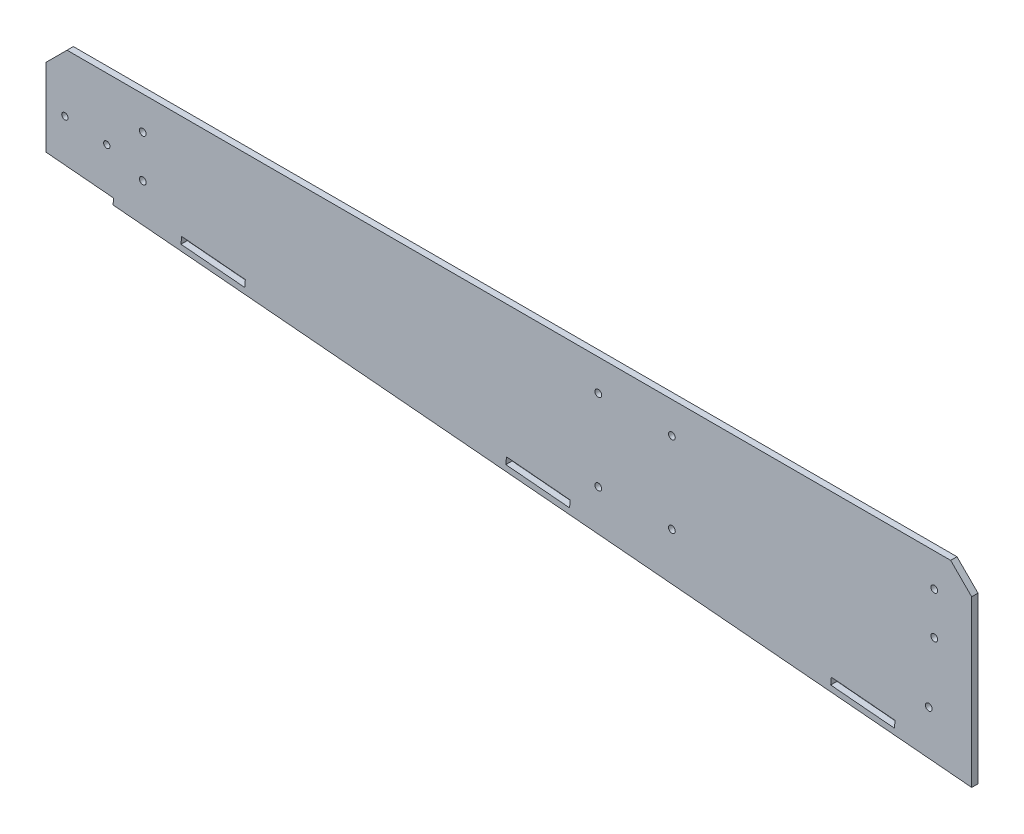
ISO-10303-21;
HEADER;
FILE_DESCRIPTION(('STEP AP214'),'2;1');
FILE_NAME('part.step','',(''),(''),'','','');
FILE_SCHEMA(('AUTOMOTIVE_DESIGN { 1 0 10303 214 1 1 1 1 }'));
ENDSEC;
DATA;
#1=APPLICATION_CONTEXT('core data for automotive mechanical design processes');
#2=APPLICATION_PROTOCOL_DEFINITION('international standard','automotive_design',2000,#1);
#3=PRODUCT_CONTEXT('',#1,'mechanical');
#4=PRODUCT('Part','Part','',(#3));
#5=PRODUCT_RELATED_PRODUCT_CATEGORY('part','',(#4));
#6=PRODUCT_DEFINITION_FORMATION('','',#4);
#7=PRODUCT_DEFINITION_CONTEXT('part definition',#1,'design');
#8=PRODUCT_DEFINITION('design','',#6,#7);
#9=PRODUCT_DEFINITION_SHAPE('','',#8);
#10=(LENGTH_UNIT() NAMED_UNIT(*) SI_UNIT(.MILLI.,.METRE.));
#11=(NAMED_UNIT(*) PLANE_ANGLE_UNIT() SI_UNIT($,.RADIAN.));
#12=(NAMED_UNIT(*) SI_UNIT($,.STERADIAN.) SOLID_ANGLE_UNIT());
#13=UNCERTAINTY_MEASURE_WITH_UNIT(LENGTH_MEASURE(1.E-05),#10,'distance_accuracy_value','');
#14=(GEOMETRIC_REPRESENTATION_CONTEXT(3) GLOBAL_UNCERTAINTY_ASSIGNED_CONTEXT((#13)) GLOBAL_UNIT_ASSIGNED_CONTEXT((#10,
#11,#12)) REPRESENTATION_CONTEXT('',''));
#15=CARTESIAN_POINT('',(0.,0.,0.));
#16=DIRECTION('',(0.,0.,1.));
#17=DIRECTION('',(1.,0.,0.));
#18=AXIS2_PLACEMENT_3D('',#15,#16,#17);
#19=CARTESIAN_POINT('',(-31.7701039956176,21.7677030305743,3.));
#20=DIRECTION('',(1.,0.,0.));
#21=DIRECTION('',(0.,0.,-1.));
#22=AXIS2_PLACEMENT_3D('',#19,#20,#21);
#23=PLANE('',#22);
#24=DIRECTION('',(0.,-1.,0.));
#25=VECTOR('',#24,1.);
#26=CARTESIAN_POINT('',(-31.7701039956176,21.7677030305743,3.));
#27=LINE('',#26,#25);
#28=CARTESIAN_POINT('',(-31.7701039956176,61.7677030305743,3.));
#29=VERTEX_POINT('',#28);
#30=CARTESIAN_POINT('',(-31.7701039956176,24.7791625432043,3.));
#31=VERTEX_POINT('',#30);
#32=EDGE_CURVE('E264',#29,#31,#27,.T.);
#33=ORIENTED_EDGE('',*,*,#32,.F.);
#34=DIRECTION('',(0.,0.,-1.));
#35=VECTOR('',#34,1.);
#36=CARTESIAN_POINT('',(-31.7701039956176,61.7677030305743,3.));
#37=LINE('',#36,#35);
#38=CARTESIAN_POINT('',(-31.7701039956176,61.7677030305743,0.));
#39=VERTEX_POINT('',#38);
#40=EDGE_CURVE('E312',#29,#39,#37,.T.);
#41=ORIENTED_EDGE('',*,*,#40,.T.);
#42=DIRECTION('',(0.,-1.,0.));
#43=VECTOR('',#42,1.);
#44=CARTESIAN_POINT('',(-31.7701039956176,21.7677030305743,0.));
#45=LINE('',#44,#43);
#46=CARTESIAN_POINT('',(-31.7701039956176,24.7791625432043,0.));
#47=VERTEX_POINT('',#46);
#48=EDGE_CURVE('E260',#39,#47,#45,.T.);
#49=ORIENTED_EDGE('',*,*,#48,.T.);
#50=DIRECTION('',(0.,0.,1.));
#51=VECTOR('',#50,1.);
#52=CARTESIAN_POINT('',(-31.7701039956176,24.7791625432043,-7.));
#53=LINE('',#52,#51);
#54=EDGE_CURVE('E257',#47,#31,#53,.T.);
#55=ORIENTED_EDGE('',*,*,#54,.T.);
#56=EDGE_LOOP('',(#33,#41,#49,#55));
#57=FACE_BOUND('',#56,.T.);
#58=ADVANCED_FACE('F35',(#57),#23,.F.);
#59=CARTESIAN_POINT('',(408.229896004382,-16.7273089208337,3.));
#60=DIRECTION('',(0.0871557427476615,0.996194698091745,0.));
#61=DIRECTION('',(-0.996194698091745,0.0871557427476615,0.));
#62=AXIS2_PLACEMENT_3D('',#59,#60,#61);
#63=PLANE('',#62);
#64=DIRECTION('',(0.996194698091745,-0.0871557427476615,0.));
#65=VECTOR('',#64,1.);
#66=CARTESIAN_POINT('',(408.229896004382,-16.7273089208337,3.));
#67=LINE('',#66,#65);
#68=CARTESIAN_POINT('',(0.108126343318207,18.9787192626491,3.));
#69=VERTEX_POINT('',#68);
#70=CARTESIAN_POINT('',(408.229896004382,-16.7273089208337,3.));
#71=VERTEX_POINT('',#70);
#72=EDGE_CURVE('E266',#69,#71,#67,.T.);
#73=ORIENTED_EDGE('',*,*,#72,.F.);
#74=DIRECTION('',(0.,0.,1.));
#75=VECTOR('',#74,1.);
#76=CARTESIAN_POINT('',(0.108126343318207,18.9787192626491,-7.));
#77=LINE('',#76,#75);
#78=CARTESIAN_POINT('',(0.108126343318207,18.9787192626491,0.));
#79=VERTEX_POINT('',#78);
#80=EDGE_CURVE('E256',#79,#69,#77,.T.);
#81=ORIENTED_EDGE('',*,*,#80,.F.);
#82=DIRECTION('',(0.996194698091745,-0.0871557427476615,0.));
#83=VECTOR('',#82,1.);
#84=CARTESIAN_POINT('',(408.229896004382,-16.7273089208337,0.));
#85=LINE('',#84,#83);
#86=CARTESIAN_POINT('',(408.229896004382,-16.7273089208337,0.));
#87=VERTEX_POINT('',#86);
#88=EDGE_CURVE('E275',#79,#87,#85,.T.);
#89=ORIENTED_EDGE('',*,*,#88,.T.);
#90=DIRECTION('',(0.,0.,-1.));
#91=VECTOR('',#90,1.);
#92=CARTESIAN_POINT('',(408.229896004382,-16.7273089208337,3.));
#93=LINE('',#92,#91);
#94=EDGE_CURVE('E273',#71,#87,#93,.T.);
#95=ORIENTED_EDGE('',*,*,#94,.F.);
#96=EDGE_LOOP('',(#73,#81,#89,#95));
#97=FACE_BOUND('',#96,.T.);
#98=ADVANCED_FACE('F348',(#97),#63,.F.);
#99=CARTESIAN_POINT('',(408.229896004382,71.7677030305743,3.));
#100=DIRECTION('',(-1.,0.,0.));
#101=DIRECTION('',(0.,0.,1.));
#102=AXIS2_PLACEMENT_3D('',#99,#100,#101);
#103=PLANE('',#102);
#104=DIRECTION('',(0.,1.,0.));
#105=VECTOR('',#104,1.);
#106=CARTESIAN_POINT('',(408.229896004382,71.7677030305743,0.));
#107=LINE('',#106,#105);
#108=CARTESIAN_POINT('',(408.229896004382,61.7677030305742,0.));
#109=VERTEX_POINT('',#108);
#110=EDGE_CURVE('E277',#87,#109,#107,.T.);
#111=ORIENTED_EDGE('',*,*,#110,.T.);
#112=DIRECTION('',(0.,0.,1.));
#113=VECTOR('',#112,1.);
#114=CARTESIAN_POINT('',(408.229896004382,61.7677030305742,3.));
#115=LINE('',#114,#113);
#116=CARTESIAN_POINT('',(408.229896004382,61.7677030305742,3.));
#117=VERTEX_POINT('',#116);
#118=EDGE_CURVE('E11',#109,#117,#115,.T.);
#119=ORIENTED_EDGE('',*,*,#118,.T.);
#120=DIRECTION('',(0.,1.,0.));
#121=VECTOR('',#120,1.);
#122=CARTESIAN_POINT('',(408.229896004382,71.7677030305743,3.));
#123=LINE('',#122,#121);
#124=EDGE_CURVE('E269',#71,#117,#123,.T.);
#125=ORIENTED_EDGE('',*,*,#124,.F.);
#126=ORIENTED_EDGE('',*,*,#94,.T.);
#127=EDGE_LOOP('',(#111,#119,#125,#126));
#128=FACE_BOUND('',#127,.T.);
#129=ADVANCED_FACE('F344',(#128),#103,.F.);
#130=CARTESIAN_POINT('',(-31.7701039956176,71.7677030305743,3.));
#131=DIRECTION('',(0.,-1.,0.));
#132=DIRECTION('',(0.,0.,-1.));
#133=AXIS2_PLACEMENT_3D('',#130,#131,#132);
#134=PLANE('',#133);
#135=DIRECTION('',(-1.,0.,0.));
#136=VECTOR('',#135,1.);
#137=CARTESIAN_POINT('',(-31.7701039956176,71.7677030305743,0.));
#138=LINE('',#137,#136);
#139=CARTESIAN_POINT('',(398.229896004382,71.7677030305743,0.));
#140=VERTEX_POINT('',#139);
#141=CARTESIAN_POINT('',(-21.7701039956176,71.7677030305743,0.));
#142=VERTEX_POINT('',#141);
#143=EDGE_CURVE('E267',#140,#142,#138,.T.);
#144=ORIENTED_EDGE('',*,*,#143,.T.);
#145=DIRECTION('',(0.,0.,1.));
#146=VECTOR('',#145,1.);
#147=CARTESIAN_POINT('',(-21.7701039956176,71.7677030305743,3.));
#148=LINE('',#147,#146);
#149=CARTESIAN_POINT('',(-21.7701039956176,71.7677030305743,3.));
#150=VERTEX_POINT('',#149);
#151=EDGE_CURVE('E56',#142,#150,#148,.T.);
#152=ORIENTED_EDGE('',*,*,#151,.T.);
#153=DIRECTION('',(-1.,0.,0.));
#154=VECTOR('',#153,1.);
#155=CARTESIAN_POINT('',(-31.7701039956176,71.7677030305743,3.));
#156=LINE('',#155,#154);
#157=CARTESIAN_POINT('',(398.229896004382,71.7677030305743,3.));
#158=VERTEX_POINT('',#157);
#159=EDGE_CURVE('E271',#158,#150,#156,.T.);
#160=ORIENTED_EDGE('',*,*,#159,.F.);
#161=DIRECTION('',(0.,0.,-1.));
#162=VECTOR('',#161,1.);
#163=CARTESIAN_POINT('',(398.229896004382,71.7677030305743,3.));
#164=LINE('',#163,#162);
#165=EDGE_CURVE('E319',#158,#140,#164,.T.);
#166=ORIENTED_EDGE('',*,*,#165,.T.);
#167=EDGE_LOOP('',(#144,#152,#160,#166));
#168=FACE_BOUND('',#167,.T.);
#169=ADVANCED_FACE('F338',(#168),#134,.F.);
#170=CARTESIAN_POINT('',(0.,0.,3.));
#171=DIRECTION('',(0.,0.,-1.));
#172=DIRECTION('',(-1.,0.,0.));
#173=AXIS2_PLACEMENT_3D('',#170,#171,#172);
#174=PLANE('',#173);
#175=CARTESIAN_POINT('',(390.440589080788,56.0238654816803,3.));
#176=DIRECTION('',(0.,0.,-1.));
#177=DIRECTION('',(-1.,0.,0.));
#178=AXIS2_PLACEMENT_3D('',#175,#176,#177);
#179=CIRCLE('',#178,1.60000000000002);
#180=CARTESIAN_POINT('',(388.840589080788,56.0238654816803,3.));
#181=VERTEX_POINT('',#180);
#182=EDGE_CURVE('E619',#181,#181,#179,.T.);
#183=ORIENTED_EDGE('',*,*,#182,.T.);
#184=EDGE_LOOP('',(#183));
#185=FACE_BOUND('',#184,.T.);
#186=CARTESIAN_POINT('',(14.2298960043213,36.0238654816881,3.));
#187=DIRECTION('',(0.,0.,-1.));
#188=DIRECTION('',(-1.,0.,0.));
#189=AXIS2_PLACEMENT_3D('',#186,#187,#188);
#190=CIRCLE('',#189,1.60000000000004);
#191=CARTESIAN_POINT('',(12.6298960043213,36.0238654816881,3.));
#192=VERTEX_POINT('',#191);
#193=EDGE_CURVE('E623',#192,#192,#190,.T.);
#194=ORIENTED_EDGE('',*,*,#193,.T.);
#195=EDGE_LOOP('',(#194));
#196=FACE_BOUND('',#195,.T.);
#197=CARTESIAN_POINT('',(14.2298960043213,56.0238654816881,3.));
#198=DIRECTION('',(0.,0.,-1.));
#199=DIRECTION('',(-1.,0.,0.));
#200=AXIS2_PLACEMENT_3D('',#197,#198,#199);
#201=CIRCLE('',#200,1.60000000000004);
#202=CARTESIAN_POINT('',(12.6298960043213,56.0238654816881,3.));
#203=VERTEX_POINT('',#202);
#204=EDGE_CURVE('E626',#203,#203,#201,.T.);
#205=ORIENTED_EDGE('',*,*,#204,.T.);
#206=EDGE_LOOP('',(#205));
#207=FACE_BOUND('',#206,.T.);
#208=CARTESIAN_POINT('',(390.440589080788,36.0238654816803,3.));
#209=DIRECTION('',(0.,0.,-1.));
#210=DIRECTION('',(-1.,0.,0.));
#211=AXIS2_PLACEMENT_3D('',#208,#209,#210);
#212=CIRCLE('',#211,1.60000000000002);
#213=CARTESIAN_POINT('',(388.840589080788,36.0238654816803,3.));
#214=VERTEX_POINT('',#213);
#215=EDGE_CURVE('E563',#214,#214,#212,.T.);
#216=ORIENTED_EDGE('',*,*,#215,.T.);
#217=EDGE_LOOP('',(#216));
#218=FACE_BOUND('',#217,.T.);
#219=CARTESIAN_POINT('',(387.825916798358,6.13802453892796,3.));
#220=DIRECTION('',(0.,0.,-1.));
#221=DIRECTION('',(-1.,0.,0.));
#222=AXIS2_PLACEMENT_3D('',#219,#220,#221);
#223=CIRCLE('',#222,1.60000000000002);
#224=CARTESIAN_POINT('',(386.225916798358,6.13802453892796,3.));
#225=VERTEX_POINT('',#224);
#226=EDGE_CURVE('E612',#225,#225,#223,.T.);
#227=ORIENTED_EDGE('',*,*,#226,.T.);
#228=EDGE_LOOP('',(#227));
#229=FACE_BOUND('',#228,.T.);
#230=CARTESIAN_POINT('',(265.729896004382,18.2779728998452,3.));
#231=DIRECTION('',(0.,0.,-1.));
#232=DIRECTION('',(-1.,0.,0.));
#233=AXIS2_PLACEMENT_3D('',#230,#231,#232);
#234=CIRCLE('',#233,1.60000000000002);
#235=CARTESIAN_POINT('',(264.129896004382,18.2779728998452,3.));
#236=VERTEX_POINT('',#235);
#237=EDGE_CURVE('E557',#236,#236,#234,.T.);
#238=ORIENTED_EDGE('',*,*,#237,.T.);
#239=EDGE_LOOP('',(#238));
#240=FACE_BOUND('',#239,.T.);
#241=CARTESIAN_POINT('',(230.729896004382,18.2779728998452,3.));
#242=DIRECTION('',(0.,0.,-1.));
#243=DIRECTION('',(-1.,0.,0.));
#244=AXIS2_PLACEMENT_3D('',#241,#242,#243);
#245=CIRCLE('',#244,1.59999999999973);
#246=CARTESIAN_POINT('',(229.129896004383,18.2779728998452,3.));
#247=VERTEX_POINT('',#246);
#248=EDGE_CURVE('E546',#247,#247,#245,.T.);
#249=ORIENTED_EDGE('',*,*,#248,.T.);
#250=EDGE_LOOP('',(#249));
#251=FACE_BOUND('',#250,.T.);
#252=CARTESIAN_POINT('',(230.729896004382,56.7835263993104,3.));
#253=DIRECTION('',(0.,0.,-1.));
#254=DIRECTION('',(-1.,0.,0.));
#255=AXIS2_PLACEMENT_3D('',#252,#253,#254);
#256=CIRCLE('',#255,1.59999999999999);
#257=CARTESIAN_POINT('',(229.129896004382,56.7835263993104,3.));
#258=VERTEX_POINT('',#257);
#259=EDGE_CURVE('E541',#258,#258,#256,.T.);
#260=ORIENTED_EDGE('',*,*,#259,.T.);
#261=EDGE_LOOP('',(#260));
#262=FACE_BOUND('',#261,.T.);
#263=CARTESIAN_POINT('',(-2.86826506399695,42.3269760325064,3.));
#264=DIRECTION('',(0.,0.,-1.));
#265=DIRECTION('',(-1.,0.,0.));
#266=AXIS2_PLACEMENT_3D('',#263,#264,#265);
#267=CIRCLE('',#266,1.49999999994489);
#268=CARTESIAN_POINT('',(-4.36826506394184,42.3269760325064,3.));
#269=VERTEX_POINT('',#268);
#270=EDGE_CURVE('E593',#269,#269,#267,.T.);
#271=ORIENTED_EDGE('',*,*,#270,.T.);
#272=EDGE_LOOP('',(#271));
#273=FACE_BOUND('',#272,.T.);
#274=CARTESIAN_POINT('',(-22.7921590258319,44.0700908874597,3.));
#275=DIRECTION('',(0.,0.,-1.));
#276=DIRECTION('',(-1.,0.,0.));
#277=AXIS2_PLACEMENT_3D('',#274,#275,#276);
#278=CIRCLE('',#277,1.49999999994489);
#279=CARTESIAN_POINT('',(-24.2921590257767,44.0700908874597,3.));
#280=VERTEX_POINT('',#279);
#281=EDGE_CURVE('E568',#280,#280,#278,.T.);
#282=ORIENTED_EDGE('',*,*,#281,.T.);
#283=EDGE_LOOP('',(#282));
#284=FACE_BOUND('',#283,.T.);
#285=CARTESIAN_POINT('',(265.729896004382,56.7835263993079,3.));
#286=DIRECTION('',(0.,0.,-1.));
#287=DIRECTION('',(-1.,0.,0.));
#288=AXIS2_PLACEMENT_3D('',#285,#286,#287);
#289=CIRCLE('',#288,1.60000000000002);
#290=CARTESIAN_POINT('',(264.129896004382,56.7835263993079,3.));
#291=VERTEX_POINT('',#290);
#292=EDGE_CURVE('E234',#291,#291,#289,.T.);
#293=ORIENTED_EDGE('',*,*,#292,.T.);
#294=EDGE_LOOP('',(#293));
#295=FACE_BOUND('',#294,.T.);
#296=DIRECTION('',(-0.0871557427476403,-0.996194698091747,0.));
#297=VECTOR('',#296,1.);
#298=CARTESIAN_POINT('',(341.508011452001,-4.66621742064363,3.));
#299=LINE('',#298,#297);
#300=CARTESIAN_POINT('',(341.508011452001,-4.66621742064363,3.));
#301=VERTEX_POINT('',#300);
#302=CARTESIAN_POINT('',(341.211681926659,-8.05327939415556,3.));
#303=VERTEX_POINT('',#302);
#304=EDGE_CURVE('E190',#301,#303,#299,.T.);
#305=ORIENTED_EDGE('',*,*,#304,.F.);
#306=DIRECTION('',(-0.996194698091747,0.0871557427476466,0.));
#307=VECTOR('',#306,1.);
#308=CARTESIAN_POINT('',(371.792330273991,-7.31575200017209,3.));
#309=LINE('',#308,#307);
#310=CARTESIAN_POINT('',(371.792330273991,-7.31575200017209,3.));
#311=VERTEX_POINT('',#310);
#312=EDGE_CURVE('E195',#311,#301,#309,.T.);
#313=ORIENTED_EDGE('',*,*,#312,.F.);
#314=DIRECTION('',(0.0871557427476403,0.996194698091747,0.));
#315=VECTOR('',#314,1.);
#316=CARTESIAN_POINT('',(371.792330273991,-7.31575200017209,3.));
#317=LINE('',#316,#315);
#318=CARTESIAN_POINT('',(371.496000748649,-10.702813973684,3.));
#319=VERTEX_POINT('',#318);
#320=EDGE_CURVE('E200',#319,#311,#317,.T.);
#321=ORIENTED_EDGE('',*,*,#320,.F.);
#322=DIRECTION('',(0.996194698091747,-0.0871557427476467,0.));
#323=VECTOR('',#322,1.);
#324=CARTESIAN_POINT('',(371.496000748649,-10.702813973684,3.));
#325=LINE('',#324,#323);
#326=EDGE_CURVE('E179',#303,#319,#325,.T.);
#327=ORIENTED_EDGE('',*,*,#326,.F.);
#328=EDGE_LOOP('',(#305,#313,#321,#327));
#329=FACE_BOUND('',#328,.T.);
#330=DIRECTION('',(-0.0871557427476403,-0.996194698091747,0.));
#331=VECTOR('',#330,1.);
#332=CARTESIAN_POINT('',(187.097833247781,8.8429227052439,3.));
#333=LINE('',#332,#331);
#334=CARTESIAN_POINT('',(187.097833247781,8.8429227052439,3.));
#335=VERTEX_POINT('',#334);
#336=CARTESIAN_POINT('',(186.801503722439,5.45586073173197,3.));
#337=VERTEX_POINT('',#336);
#338=EDGE_CURVE('E212',#335,#337,#333,.T.);
#339=ORIENTED_EDGE('',*,*,#338,.F.);
#340=DIRECTION('',(-0.996194698091747,0.0871557427476466,0.));
#341=VECTOR('',#340,1.);
#342=CARTESIAN_POINT('',(217.38215206977,6.19338812571544,3.));
#343=LINE('',#342,#341);
#344=CARTESIAN_POINT('',(217.38215206977,6.19338812571544,3.));
#345=VERTEX_POINT('',#344);
#346=EDGE_CURVE('E210',#345,#335,#343,.T.);
#347=ORIENTED_EDGE('',*,*,#346,.F.);
#348=DIRECTION('',(0.0871557427476403,0.996194698091747,0.));
#349=VECTOR('',#348,1.);
#350=CARTESIAN_POINT('',(217.38215206977,6.19338812571544,3.));
#351=LINE('',#350,#349);
#352=CARTESIAN_POINT('',(217.085822544428,2.8063261522035,3.));
#353=VERTEX_POINT('',#352);
#354=EDGE_CURVE('E219',#353,#345,#351,.T.);
#355=ORIENTED_EDGE('',*,*,#354,.F.);
#356=DIRECTION('',(0.996194698091747,-0.0871557427476467,0.));
#357=VECTOR('',#356,1.);
#358=CARTESIAN_POINT('',(217.085822544428,2.8063261522035,3.));
#359=LINE('',#358,#357);
#360=EDGE_CURVE('E216',#337,#353,#359,.T.);
#361=ORIENTED_EDGE('',*,*,#360,.F.);
#362=EDGE_LOOP('',(#339,#347,#355,#361));
#363=FACE_BOUND('',#362,.T.);
#364=DIRECTION('',(-0.0871557427476403,-0.996194698091747,0.));
#365=VECTOR('',#364,1.);
#366=CARTESIAN_POINT('',(32.6876550435604,22.3520628311314,3.));
#367=LINE('',#366,#365);
#368=CARTESIAN_POINT('',(32.6876550435604,22.3520628311314,3.));
#369=VERTEX_POINT('',#368);
#370=CARTESIAN_POINT('',(32.3913255182184,18.9650008576195,3.));
#371=VERTEX_POINT('',#370);
#372=EDGE_CURVE('E233',#369,#371,#367,.T.);
#373=ORIENTED_EDGE('',*,*,#372,.F.);
#374=DIRECTION('',(-0.996194698091747,0.0871557427476467,0.));
#375=VECTOR('',#374,1.);
#376=CARTESIAN_POINT('',(62.9719738655495,19.702528251603,3.));
#377=LINE('',#376,#375);
#378=CARTESIAN_POINT('',(62.9719738655495,19.702528251603,3.));
#379=VERTEX_POINT('',#378);
#380=EDGE_CURVE('E231',#379,#369,#377,.T.);
#381=ORIENTED_EDGE('',*,*,#380,.F.);
#382=DIRECTION('',(0.0871557427476403,0.996194698091747,0.));
#383=VECTOR('',#382,1.);
#384=CARTESIAN_POINT('',(62.9719738655495,19.702528251603,3.));
#385=LINE('',#384,#383);
#386=CARTESIAN_POINT('',(62.6756443402076,16.315466278091,3.));
#387=VERTEX_POINT('',#386);
#388=EDGE_CURVE('E240',#387,#379,#385,.T.);
#389=ORIENTED_EDGE('',*,*,#388,.F.);
#390=DIRECTION('',(0.996194698091747,-0.0871557427476467,0.));
#391=VECTOR('',#390,1.);
#392=CARTESIAN_POINT('',(62.6756443402076,16.315466278091,3.));
#393=LINE('',#392,#391);
#394=EDGE_CURVE('E237',#371,#387,#393,.T.);
#395=ORIENTED_EDGE('',*,*,#394,.F.);
#396=EDGE_LOOP('',(#373,#381,#389,#395));
#397=FACE_BOUND('',#396,.T.);
#398=ORIENTED_EDGE('',*,*,#159,.T.);
#399=DIRECTION('',(0.707106781186549,0.707106781186546,0.));
#400=VECTOR('',#399,1.);
#401=CARTESIAN_POINT('',(-31.7701039956176,61.7677030305743,3.));
#402=LINE('',#401,#400);
#403=EDGE_CURVE('E43',#150,#29,#402,.F.);
#404=ORIENTED_EDGE('',*,*,#403,.T.);
#405=ORIENTED_EDGE('',*,*,#32,.T.);
#406=DIRECTION('',(-0.996194698091745,0.0871557427476614,0.));
#407=VECTOR('',#406,1.);
#408=CARTESIAN_POINT('',(0.36959357156119,21.9673033569244,3.));
#409=LINE('',#408,#407);
#410=CARTESIAN_POINT('',(0.36959357156119,21.9673033569244,3.));
#411=VERTEX_POINT('',#410);
#412=EDGE_CURVE('E253',#411,#31,#409,.T.);
#413=ORIENTED_EDGE('',*,*,#412,.F.);
#414=DIRECTION('',(0.0871557427476612,0.996194698091745,0.));
#415=VECTOR('',#414,1.);
#416=CARTESIAN_POINT('',(0.108126343318207,18.9787192626491,3.));
#417=LINE('',#416,#415);
#418=EDGE_CURVE('E207',#69,#411,#417,.T.);
#419=ORIENTED_EDGE('',*,*,#418,.F.);
#420=ORIENTED_EDGE('',*,*,#72,.T.);
#421=ORIENTED_EDGE('',*,*,#124,.T.);
#422=DIRECTION('',(0.707106781186546,-0.707106781186549,0.));
#423=VECTOR('',#422,1.);
#424=CARTESIAN_POINT('',(398.229896004382,71.7677030305743,3.));
#425=LINE('',#424,#423);
#426=EDGE_CURVE('E323',#117,#158,#425,.F.);
#427=ORIENTED_EDGE('',*,*,#426,.T.);
#428=EDGE_LOOP('',(#398,#404,#405,#413,#419,#420,#421,#427));
#429=FACE_BOUND('',#428,.T.);
#430=ADVANCED_FACE('F197',(#185,#196,#207,#218,#229,#240,#251,#262,#273,#284,#295,#329,#363,
#397,#429),#174,.F.);
#431=CARTESIAN_POINT('',(0.,0.,0.));
#432=DIRECTION('',(0.,0.,-1.));
#433=DIRECTION('',(-1.,0.,0.));
#434=AXIS2_PLACEMENT_3D('',#431,#432,#433);
#435=PLANE('',#434);
#436=CARTESIAN_POINT('',(390.440589080788,56.0238654816803,0.));
#437=DIRECTION('',(0.,0.,-1.));
#438=DIRECTION('',(-1.,0.,0.));
#439=AXIS2_PLACEMENT_3D('',#436,#437,#438);
#440=CIRCLE('',#439,1.60000000000002);
#441=CARTESIAN_POINT('',(388.840589080788,56.0238654816803,0.));
#442=VERTEX_POINT('',#441);
#443=EDGE_CURVE('E629',#442,#442,#440,.T.);
#444=ORIENTED_EDGE('',*,*,#443,.F.);
#445=EDGE_LOOP('',(#444));
#446=FACE_BOUND('',#445,.T.);
#447=CARTESIAN_POINT('',(14.2298960043213,36.0238654816881,0.));
#448=DIRECTION('',(0.,0.,-1.));
#449=DIRECTION('',(-1.,0.,0.));
#450=AXIS2_PLACEMENT_3D('',#447,#448,#449);
#451=CIRCLE('',#450,1.60000000000004);
#452=CARTESIAN_POINT('',(12.6298960043213,36.0238654816881,0.));
#453=VERTEX_POINT('',#452);
#454=EDGE_CURVE('E633',#453,#453,#451,.T.);
#455=ORIENTED_EDGE('',*,*,#454,.F.);
#456=EDGE_LOOP('',(#455));
#457=FACE_BOUND('',#456,.T.);
#458=CARTESIAN_POINT('',(14.2298960043213,56.0238654816881,0.));
#459=DIRECTION('',(0.,0.,-1.));
#460=DIRECTION('',(-1.,0.,0.));
#461=AXIS2_PLACEMENT_3D('',#458,#459,#460);
#462=CIRCLE('',#461,1.60000000000004);
#463=CARTESIAN_POINT('',(12.6298960043213,56.0238654816881,0.));
#464=VERTEX_POINT('',#463);
#465=EDGE_CURVE('E630',#464,#464,#462,.T.);
#466=ORIENTED_EDGE('',*,*,#465,.F.);
#467=EDGE_LOOP('',(#466));
#468=FACE_BOUND('',#467,.T.);
#469=CARTESIAN_POINT('',(390.440589080788,36.0238654816803,0.));
#470=DIRECTION('',(0.,0.,-1.));
#471=DIRECTION('',(-1.,0.,0.));
#472=AXIS2_PLACEMENT_3D('',#469,#470,#471);
#473=CIRCLE('',#472,1.60000000000002);
#474=CARTESIAN_POINT('',(388.840589080788,36.0238654816803,0.));
#475=VERTEX_POINT('',#474);
#476=EDGE_CURVE('E615',#475,#475,#473,.T.);
#477=ORIENTED_EDGE('',*,*,#476,.F.);
#478=EDGE_LOOP('',(#477));
#479=FACE_BOUND('',#478,.T.);
#480=CARTESIAN_POINT('',(387.825916798358,6.13802453892796,0.));
#481=DIRECTION('',(0.,0.,-1.));
#482=DIRECTION('',(-1.,0.,0.));
#483=AXIS2_PLACEMENT_3D('',#480,#481,#482);
#484=CIRCLE('',#483,1.60000000000002);
#485=CARTESIAN_POINT('',(386.225916798358,6.13802453892796,0.));
#486=VERTEX_POINT('',#485);
#487=EDGE_CURVE('E616',#486,#486,#484,.T.);
#488=ORIENTED_EDGE('',*,*,#487,.F.);
#489=EDGE_LOOP('',(#488));
#490=FACE_BOUND('',#489,.T.);
#491=CARTESIAN_POINT('',(265.729896004382,18.2779728998452,0.));
#492=DIRECTION('',(0.,0.,-1.));
#493=DIRECTION('',(-1.,0.,0.));
#494=AXIS2_PLACEMENT_3D('',#491,#492,#493);
#495=CIRCLE('',#494,1.60000000000002);
#496=CARTESIAN_POINT('',(264.129896004382,18.2779728998452,0.));
#497=VERTEX_POINT('',#496);
#498=EDGE_CURVE('E560',#497,#497,#495,.T.);
#499=ORIENTED_EDGE('',*,*,#498,.F.);
#500=EDGE_LOOP('',(#499));
#501=FACE_BOUND('',#500,.T.);
#502=CARTESIAN_POINT('',(230.729896004382,18.2779728998452,0.));
#503=DIRECTION('',(0.,0.,-1.));
#504=DIRECTION('',(-1.,0.,0.));
#505=AXIS2_PLACEMENT_3D('',#502,#503,#504);
#506=CIRCLE('',#505,1.59999999999973);
#507=CARTESIAN_POINT('',(229.129896004383,18.2779728998452,0.));
#508=VERTEX_POINT('',#507);
#509=EDGE_CURVE('E551',#508,#508,#506,.T.);
#510=ORIENTED_EDGE('',*,*,#509,.F.);
#511=EDGE_LOOP('',(#510));
#512=FACE_BOUND('',#511,.T.);
#513=CARTESIAN_POINT('',(230.729896004382,56.7835263993104,0.));
#514=DIRECTION('',(0.,0.,-1.));
#515=DIRECTION('',(-1.,0.,0.));
#516=AXIS2_PLACEMENT_3D('',#513,#514,#515);
#517=CIRCLE('',#516,1.59999999999999);
#518=CARTESIAN_POINT('',(229.129896004382,56.7835263993104,0.));
#519=VERTEX_POINT('',#518);
#520=EDGE_CURVE('E544',#519,#519,#517,.T.);
#521=ORIENTED_EDGE('',*,*,#520,.F.);
#522=EDGE_LOOP('',(#521));
#523=FACE_BOUND('',#522,.T.);
#524=CARTESIAN_POINT('',(-2.86826506399695,42.3269760325064,0.));
#525=DIRECTION('',(0.,0.,-1.));
#526=DIRECTION('',(-1.,0.,0.));
#527=AXIS2_PLACEMENT_3D('',#524,#525,#526);
#528=CIRCLE('',#527,1.49999999994489);
#529=CARTESIAN_POINT('',(-4.36826506394184,42.3269760325064,0.));
#530=VERTEX_POINT('',#529);
#531=EDGE_CURVE('E548',#530,#530,#528,.T.);
#532=ORIENTED_EDGE('',*,*,#531,.F.);
#533=EDGE_LOOP('',(#532));
#534=FACE_BOUND('',#533,.T.);
#535=CARTESIAN_POINT('',(-22.7921590258319,44.0700908874597,0.));
#536=DIRECTION('',(0.,0.,-1.));
#537=DIRECTION('',(-1.,0.,0.));
#538=AXIS2_PLACEMENT_3D('',#535,#536,#537);
#539=CIRCLE('',#538,1.49999999994489);
#540=CARTESIAN_POINT('',(-24.2921590257767,44.0700908874597,0.));
#541=VERTEX_POINT('',#540);
#542=EDGE_CURVE('E588',#541,#541,#539,.T.);
#543=ORIENTED_EDGE('',*,*,#542,.F.);
#544=EDGE_LOOP('',(#543));
#545=FACE_BOUND('',#544,.T.);
#546=CARTESIAN_POINT('',(265.729896004382,56.7835263993079,0.));
#547=DIRECTION('',(0.,0.,-1.));
#548=DIRECTION('',(-1.,0.,0.));
#549=AXIS2_PLACEMENT_3D('',#546,#547,#548);
#550=CIRCLE('',#549,1.60000000000002);
#551=CARTESIAN_POINT('',(264.129896004382,56.7835263993079,0.));
#552=VERTEX_POINT('',#551);
#553=EDGE_CURVE('E566',#552,#552,#550,.T.);
#554=ORIENTED_EDGE('',*,*,#553,.F.);
#555=EDGE_LOOP('',(#554));
#556=FACE_BOUND('',#555,.T.);
#557=DIRECTION('',(0.996194698091747,-0.0871557427476466,0.));
#558=VECTOR('',#557,1.);
#559=CARTESIAN_POINT('',(2.18899695329738,25.0203496667776,0.));
#560=LINE('',#559,#558);
#561=CARTESIAN_POINT('',(341.508011452001,-4.66621742064363,0.));
#562=VERTEX_POINT('',#561);
#563=CARTESIAN_POINT('',(371.792330273991,-7.31575200017209,0.));
#564=VERTEX_POINT('',#563);
#565=EDGE_CURVE('E310',#562,#564,#560,.T.);
#566=ORIENTED_EDGE('',*,*,#565,.F.);
#567=DIRECTION('',(0.0871557427476403,0.996194698091747,0.));
#568=VECTOR('',#567,1.);
#569=CARTESIAN_POINT('',(339.319014498704,-29.6865670874191,0.));
#570=LINE('',#569,#568);
#571=CARTESIAN_POINT('',(341.211681926659,-8.05327939415556,0.));
#572=VERTEX_POINT('',#571);
#573=EDGE_CURVE('E305',#572,#562,#570,.T.);
#574=ORIENTED_EDGE('',*,*,#573,.F.);
#575=DIRECTION('',(-0.996194698091747,0.0871557427476467,0.));
#576=VECTOR('',#575,1.);
#577=CARTESIAN_POINT('',(1.89266742795539,21.6332876932657,0.));
#578=LINE('',#577,#576);
#579=CARTESIAN_POINT('',(371.496000748649,-10.702813973684,0.));
#580=VERTEX_POINT('',#579);
#581=EDGE_CURVE('E182',#580,#572,#578,.T.);
#582=ORIENTED_EDGE('',*,*,#581,.F.);
#583=DIRECTION('',(-0.0871557427476403,-0.996194698091747,0.));
#584=VECTOR('',#583,1.);
#585=CARTESIAN_POINT('',(369.603333320693,-32.3361016669474,0.));
#586=LINE('',#585,#584);
#587=EDGE_CURVE('E308',#564,#580,#586,.T.);
#588=ORIENTED_EDGE('',*,*,#587,.F.);
#589=EDGE_LOOP('',(#566,#574,#582,#588));
#590=FACE_BOUND('',#589,.T.);
#591=DIRECTION('',(0.996194698091747,-0.0871557427476466,0.));
#592=VECTOR('',#591,1.);
#593=CARTESIAN_POINT('',(2.18899695329758,25.0203496667799,0.));
#594=LINE('',#593,#592);
#595=CARTESIAN_POINT('',(187.097833247781,8.8429227052439,0.));
#596=VERTEX_POINT('',#595);
#597=CARTESIAN_POINT('',(217.38215206977,6.19338812571544,0.));
#598=VERTEX_POINT('',#597);
#599=EDGE_CURVE('E303',#596,#598,#594,.T.);
#600=ORIENTED_EDGE('',*,*,#599,.F.);
#601=DIRECTION('',(0.0871557427476403,0.996194698091747,0.));
#602=VECTOR('',#601,1.);
#603=CARTESIAN_POINT('',(184.908836294484,-16.1774269615349,0.));
#604=LINE('',#603,#602);
#605=CARTESIAN_POINT('',(186.801503722439,5.45586073173197,0.));
#606=VERTEX_POINT('',#605);
#607=EDGE_CURVE('E296',#606,#596,#604,.T.);
#608=ORIENTED_EDGE('',*,*,#607,.F.);
#609=DIRECTION('',(-0.996194698091747,0.0871557427476467,0.));
#610=VECTOR('',#609,1.);
#611=CARTESIAN_POINT('',(1.89266742795559,21.633287693268,0.));
#612=LINE('',#611,#610);
#613=CARTESIAN_POINT('',(217.085822544428,2.8063261522035,0.));
#614=VERTEX_POINT('',#613);
#615=EDGE_CURVE('E298',#614,#606,#612,.T.);
#616=ORIENTED_EDGE('',*,*,#615,.F.);
#617=DIRECTION('',(-0.0871557427476403,-0.996194698091747,0.));
#618=VECTOR('',#617,1.);
#619=CARTESIAN_POINT('',(215.193155116473,-18.8269615410632,0.));
#620=LINE('',#619,#618);
#621=EDGE_CURVE('E301',#598,#614,#620,.T.);
#622=ORIENTED_EDGE('',*,*,#621,.F.);
#623=EDGE_LOOP('',(#600,#608,#616,#622));
#624=FACE_BOUND('',#623,.T.);
#625=DIRECTION('',(0.996194698091747,-0.0871557427476467,0.));
#626=VECTOR('',#625,1.);
#627=CARTESIAN_POINT('',(2.18899695329779,25.0203496667822,0.));
#628=LINE('',#627,#626);
#629=CARTESIAN_POINT('',(32.6876550435604,22.3520628311314,0.));
#630=VERTEX_POINT('',#629);
#631=CARTESIAN_POINT('',(62.9719738655495,19.702528251603,0.));
#632=VERTEX_POINT('',#631);
#633=EDGE_CURVE('E294',#630,#632,#628,.T.);
#634=ORIENTED_EDGE('',*,*,#633,.F.);
#635=DIRECTION('',(0.0871557427476403,0.996194698091747,0.));
#636=VECTOR('',#635,1.);
#637=CARTESIAN_POINT('',(30.4986580902628,-2.66828683565065,0.));
#638=LINE('',#637,#636);
#639=CARTESIAN_POINT('',(32.3913255182184,18.9650008576195,0.));
#640=VERTEX_POINT('',#639);
#641=EDGE_CURVE('E287',#640,#630,#638,.T.);
#642=ORIENTED_EDGE('',*,*,#641,.F.);
#643=DIRECTION('',(-0.996194698091747,0.0871557427476467,0.));
#644=VECTOR('',#643,1.);
#645=CARTESIAN_POINT('',(1.89266742795579,21.6332876932703,0.));
#646=LINE('',#645,#644);
#647=CARTESIAN_POINT('',(62.6756443402076,16.315466278091,0.));
#648=VERTEX_POINT('',#647);
#649=EDGE_CURVE('E289',#648,#640,#646,.T.);
#650=ORIENTED_EDGE('',*,*,#649,.F.);
#651=DIRECTION('',(-0.0871557427476403,-0.996194698091747,0.));
#652=VECTOR('',#651,1.);
#653=CARTESIAN_POINT('',(60.7829769122519,-5.31782141517892,0.));
#654=LINE('',#653,#652);
#655=EDGE_CURVE('E292',#632,#648,#654,.T.);
#656=ORIENTED_EDGE('',*,*,#655,.F.);
#657=EDGE_LOOP('',(#634,#642,#650,#656));
#658=FACE_BOUND('',#657,.T.);
#659=ORIENTED_EDGE('',*,*,#48,.F.);
#660=DIRECTION('',(-0.707106781186549,-0.707106781186546,0.));
#661=VECTOR('',#660,1.);
#662=CARTESIAN_POINT('',(-46.7689035130959,46.7689035130962,0.));
#663=LINE('',#662,#661);
#664=EDGE_CURVE('E317',#39,#142,#663,.F.);
#665=ORIENTED_EDGE('',*,*,#664,.T.);
#666=ORIENTED_EDGE('',*,*,#143,.F.);
#667=DIRECTION('',(-0.707106781186546,0.707106781186549,0.));
#668=VECTOR('',#667,1.);
#669=CARTESIAN_POINT('',(234.998799517479,234.998799517478,0.));
#670=LINE('',#669,#668);
#671=EDGE_CURVE('E315',#140,#109,#670,.F.);
#672=ORIENTED_EDGE('',*,*,#671,.T.);
#673=ORIENTED_EDGE('',*,*,#110,.F.);
#674=ORIENTED_EDGE('',*,*,#88,.F.);
#675=DIRECTION('',(-0.0871557427476612,-0.996194698091745,0.));
#676=VECTOR('',#675,1.);
#677=CARTESIAN_POINT('',(-1.54050500494428,0.134776724037577,0.));
#678=LINE('',#677,#676);
#679=CARTESIAN_POINT('',(0.369593571561191,21.9673033569244,0.));
#680=VERTEX_POINT('',#679);
#681=EDGE_CURVE('E282',#680,#79,#678,.T.);
#682=ORIENTED_EDGE('',*,*,#681,.F.);
#683=DIRECTION('',(0.996194698091745,-0.0871557427476614,0.));
#684=VECTOR('',#683,1.);
#685=CARTESIAN_POINT('',(1.91009857650548,21.8325266328868,0.));
#686=LINE('',#685,#684);
#687=EDGE_CURVE('E284',#47,#680,#686,.T.);
#688=ORIENTED_EDGE('',*,*,#687,.F.);
#689=EDGE_LOOP('',(#659,#665,#666,#672,#673,#674,#682,#688));
#690=FACE_BOUND('',#689,.T.);
#691=ADVANCED_FACE('F336',(#446,#457,#468,#479,#490,#501,#512,#523,#534,#545,#556,#590,#624,
#658,#690),#435,.T.);
#692=CARTESIAN_POINT('',(0.36959357156119,21.9673033569244,-7.));
#693=DIRECTION('',(0.0871557427476614,0.996194698091745,0.));
#694=DIRECTION('',(-0.996194698091745,0.0871557427476614,0.));
#695=AXIS2_PLACEMENT_3D('',#692,#693,#694);
#696=PLANE('',#695);
#697=ORIENTED_EDGE('',*,*,#687,.T.);
#698=DIRECTION('',(0.,0.,1.));
#699=VECTOR('',#698,1.);
#700=CARTESIAN_POINT('',(0.36959357156119,21.9673033569244,-7.));
#701=LINE('',#700,#699);
#702=EDGE_CURVE('E261',#680,#411,#701,.T.);
#703=ORIENTED_EDGE('',*,*,#702,.T.);
#704=ORIENTED_EDGE('',*,*,#412,.T.);
#705=ORIENTED_EDGE('',*,*,#54,.F.);
#706=EDGE_LOOP('',(#697,#703,#704,#705));
#707=FACE_BOUND('',#706,.T.);
#708=ADVANCED_FACE('F355',(#707),#696,.F.);
#709=CARTESIAN_POINT('',(0.108126343318207,18.9787192626491,-7.));
#710=DIRECTION('',(0.996194698091745,-0.0871557427476612,0.));
#711=DIRECTION('',(0.0871557427476612,0.996194698091745,0.));
#712=AXIS2_PLACEMENT_3D('',#709,#710,#711);
#713=PLANE('',#712);
#714=ORIENTED_EDGE('',*,*,#681,.T.);
#715=ORIENTED_EDGE('',*,*,#80,.T.);
#716=ORIENTED_EDGE('',*,*,#418,.T.);
#717=ORIENTED_EDGE('',*,*,#702,.F.);
#718=EDGE_LOOP('',(#714,#715,#716,#717));
#719=FACE_BOUND('',#718,.T.);
#720=ADVANCED_FACE('F352',(#719),#713,.F.);
#721=CARTESIAN_POINT('',(62.9719738655495,19.702528251603,-7.));
#722=DIRECTION('',(0.0871557427476467,0.996194698091747,0.));
#723=DIRECTION('',(-0.996194698091747,0.0871557427476467,0.));
#724=AXIS2_PLACEMENT_3D('',#721,#722,#723);
#725=PLANE('',#724);
#726=ORIENTED_EDGE('',*,*,#633,.T.);
#727=DIRECTION('',(0.,0.,1.));
#728=VECTOR('',#727,1.);
#729=CARTESIAN_POINT('',(62.9719738655495,19.702528251603,-7.));
#730=LINE('',#729,#728);
#731=EDGE_CURVE('E213',#632,#379,#730,.T.);
#732=ORIENTED_EDGE('',*,*,#731,.T.);
#733=ORIENTED_EDGE('',*,*,#380,.T.);
#734=DIRECTION('',(0.,0.,1.));
#735=VECTOR('',#734,1.);
#736=CARTESIAN_POINT('',(32.6876550435604,22.3520628311314,-7.));
#737=LINE('',#736,#735);
#738=EDGE_CURVE('E243',#630,#369,#737,.T.);
#739=ORIENTED_EDGE('',*,*,#738,.F.);
#740=EDGE_LOOP('',(#726,#732,#733,#739));
#741=FACE_BOUND('',#740,.T.);
#742=ADVANCED_FACE('F362',(#741),#725,.F.);
#743=CARTESIAN_POINT('',(62.9719738655495,19.702528251603,-7.));
#744=DIRECTION('',(0.996194698091747,-0.0871557427476403,0.));
#745=DIRECTION('',(0.0871557427476403,0.996194698091747,0.));
#746=AXIS2_PLACEMENT_3D('',#743,#744,#745);
#747=PLANE('',#746);
#748=ORIENTED_EDGE('',*,*,#655,.T.);
#749=DIRECTION('',(0.,0.,1.));
#750=VECTOR('',#749,1.);
#751=CARTESIAN_POINT('',(62.6756443402076,16.315466278091,-7.));
#752=LINE('',#751,#750);
#753=EDGE_CURVE('E245',#648,#387,#752,.T.);
#754=ORIENTED_EDGE('',*,*,#753,.T.);
#755=ORIENTED_EDGE('',*,*,#388,.T.);
#756=ORIENTED_EDGE('',*,*,#731,.F.);
#757=EDGE_LOOP('',(#748,#754,#755,#756));
#758=FACE_BOUND('',#757,.T.);
#759=ADVANCED_FACE('F429',(#758),#747,.F.);
#760=CARTESIAN_POINT('',(62.6756443402076,16.315466278091,-7.));
#761=DIRECTION('',(-0.0871557427476467,-0.996194698091747,0.));
#762=DIRECTION('',(0.996194698091747,-0.0871557427476467,0.));
#763=AXIS2_PLACEMENT_3D('',#760,#761,#762);
#764=PLANE('',#763);
#765=ORIENTED_EDGE('',*,*,#649,.T.);
#766=DIRECTION('',(0.,0.,1.));
#767=VECTOR('',#766,1.);
#768=CARTESIAN_POINT('',(32.3913255182184,18.9650008576195,-7.));
#769=LINE('',#768,#767);
#770=EDGE_CURVE('E247',#640,#371,#769,.T.);
#771=ORIENTED_EDGE('',*,*,#770,.T.);
#772=ORIENTED_EDGE('',*,*,#394,.T.);
#773=ORIENTED_EDGE('',*,*,#753,.F.);
#774=EDGE_LOOP('',(#765,#771,#772,#773));
#775=FACE_BOUND('',#774,.T.);
#776=ADVANCED_FACE('F432',(#775),#764,.F.);
#777=CARTESIAN_POINT('',(32.6876550435604,22.3520628311314,-7.));
#778=DIRECTION('',(-0.996194698091747,0.0871557427476403,0.));
#779=DIRECTION('',(-0.0871557427476403,-0.996194698091747,0.));
#780=AXIS2_PLACEMENT_3D('',#777,#778,#779);
#781=PLANE('',#780);
#782=ORIENTED_EDGE('',*,*,#641,.T.);
#783=ORIENTED_EDGE('',*,*,#738,.T.);
#784=ORIENTED_EDGE('',*,*,#372,.T.);
#785=ORIENTED_EDGE('',*,*,#770,.F.);
#786=EDGE_LOOP('',(#782,#783,#784,#785));
#787=FACE_BOUND('',#786,.T.);
#788=ADVANCED_FACE('F427',(#787),#781,.F.);
#789=CARTESIAN_POINT('',(217.38215206977,6.19338812571544,-7.));
#790=DIRECTION('',(0.0871557427476466,0.996194698091747,0.));
#791=DIRECTION('',(-0.996194698091747,0.0871557427476466,0.));
#792=AXIS2_PLACEMENT_3D('',#789,#790,#791);
#793=PLANE('',#792);
#794=ORIENTED_EDGE('',*,*,#599,.T.);
#795=DIRECTION('',(0.,0.,1.));
#796=VECTOR('',#795,1.);
#797=CARTESIAN_POINT('',(217.38215206977,6.19338812571544,-7.));
#798=LINE('',#797,#796);
#799=EDGE_CURVE('E223',#598,#345,#798,.T.);
#800=ORIENTED_EDGE('',*,*,#799,.T.);
#801=ORIENTED_EDGE('',*,*,#346,.T.);
#802=DIRECTION('',(0.,0.,1.));
#803=VECTOR('',#802,1.);
#804=CARTESIAN_POINT('',(187.097833247781,8.8429227052439,-7.));
#805=LINE('',#804,#803);
#806=EDGE_CURVE('E222',#596,#335,#805,.T.);
#807=ORIENTED_EDGE('',*,*,#806,.F.);
#808=EDGE_LOOP('',(#794,#800,#801,#807));
#809=FACE_BOUND('',#808,.T.);
#810=ADVANCED_FACE('F417',(#809),#793,.F.);
#811=CARTESIAN_POINT('',(217.38215206977,6.19338812571544,-7.));
#812=DIRECTION('',(0.996194698091747,-0.0871557427476403,0.));
#813=DIRECTION('',(0.0871557427476403,0.996194698091747,0.));
#814=AXIS2_PLACEMENT_3D('',#811,#812,#813);
#815=PLANE('',#814);
#816=ORIENTED_EDGE('',*,*,#621,.T.);
#817=DIRECTION('',(0.,0.,1.));
#818=VECTOR('',#817,1.);
#819=CARTESIAN_POINT('',(217.085822544428,2.8063261522035,-7.));
#820=LINE('',#819,#818);
#821=EDGE_CURVE('E225',#614,#353,#820,.T.);
#822=ORIENTED_EDGE('',*,*,#821,.T.);
#823=ORIENTED_EDGE('',*,*,#354,.T.);
#824=ORIENTED_EDGE('',*,*,#799,.F.);
#825=EDGE_LOOP('',(#816,#822,#823,#824));
#826=FACE_BOUND('',#825,.T.);
#827=ADVANCED_FACE('F413',(#826),#815,.F.);
#828=CARTESIAN_POINT('',(217.085822544428,2.8063261522035,-7.));
#829=DIRECTION('',(-0.0871557427476467,-0.996194698091747,0.));
#830=DIRECTION('',(0.996194698091747,-0.0871557427476467,0.));
#831=AXIS2_PLACEMENT_3D('',#828,#829,#830);
#832=PLANE('',#831);
#833=ORIENTED_EDGE('',*,*,#615,.T.);
#834=DIRECTION('',(0.,0.,1.));
#835=VECTOR('',#834,1.);
#836=CARTESIAN_POINT('',(186.801503722439,5.45586073173197,-7.));
#837=LINE('',#836,#835);
#838=EDGE_CURVE('E227',#606,#337,#837,.T.);
#839=ORIENTED_EDGE('',*,*,#838,.T.);
#840=ORIENTED_EDGE('',*,*,#360,.T.);
#841=ORIENTED_EDGE('',*,*,#821,.F.);
#842=EDGE_LOOP('',(#833,#839,#840,#841));
#843=FACE_BOUND('',#842,.T.);
#844=ADVANCED_FACE('F416',(#843),#832,.F.);
#845=CARTESIAN_POINT('',(187.097833247781,8.8429227052439,-7.));
#846=DIRECTION('',(-0.996194698091747,0.0871557427476403,0.));
#847=DIRECTION('',(-0.0871557427476403,-0.996194698091747,0.));
#848=AXIS2_PLACEMENT_3D('',#845,#846,#847);
#849=PLANE('',#848);
#850=ORIENTED_EDGE('',*,*,#607,.T.);
#851=ORIENTED_EDGE('',*,*,#806,.T.);
#852=ORIENTED_EDGE('',*,*,#338,.T.);
#853=ORIENTED_EDGE('',*,*,#838,.F.);
#854=EDGE_LOOP('',(#850,#851,#852,#853));
#855=FACE_BOUND('',#854,.T.);
#856=ADVANCED_FACE('F411',(#855),#849,.F.);
#857=CARTESIAN_POINT('',(371.792330273991,-7.31575200017209,-7.));
#858=DIRECTION('',(0.0871557427476466,0.996194698091747,0.));
#859=DIRECTION('',(-0.996194698091747,0.0871557427476466,0.));
#860=AXIS2_PLACEMENT_3D('',#857,#858,#859);
#861=PLANE('',#860);
#862=ORIENTED_EDGE('',*,*,#565,.T.);
#863=DIRECTION('',(0.,0.,1.));
#864=VECTOR('',#863,1.);
#865=CARTESIAN_POINT('',(371.792330273991,-7.31575200017209,-7.));
#866=LINE('',#865,#864);
#867=EDGE_CURVE('E205',#564,#311,#866,.T.);
#868=ORIENTED_EDGE('',*,*,#867,.T.);
#869=ORIENTED_EDGE('',*,*,#312,.T.);
#870=DIRECTION('',(0.,0.,1.));
#871=VECTOR('',#870,1.);
#872=CARTESIAN_POINT('',(341.508011452001,-4.66621742064363,-7.));
#873=LINE('',#872,#871);
#874=EDGE_CURVE('E186',#562,#301,#873,.T.);
#875=ORIENTED_EDGE('',*,*,#874,.F.);
#876=EDGE_LOOP('',(#862,#868,#869,#875));
#877=FACE_BOUND('',#876,.T.);
#878=ADVANCED_FACE('F403',(#877),#861,.F.);
#879=CARTESIAN_POINT('',(371.792330273991,-7.31575200017209,-7.));
#880=DIRECTION('',(0.996194698091747,-0.0871557427476403,0.));
#881=DIRECTION('',(0.0871557427476403,0.996194698091747,0.));
#882=AXIS2_PLACEMENT_3D('',#879,#880,#881);
#883=PLANE('',#882);
#884=ORIENTED_EDGE('',*,*,#587,.T.);
#885=DIRECTION('',(0.,0.,1.));
#886=VECTOR('',#885,1.);
#887=CARTESIAN_POINT('',(371.496000748649,-10.702813973684,-7.));
#888=LINE('',#887,#886);
#889=EDGE_CURVE('E185',#580,#319,#888,.T.);
#890=ORIENTED_EDGE('',*,*,#889,.T.);
#891=ORIENTED_EDGE('',*,*,#320,.T.);
#892=ORIENTED_EDGE('',*,*,#867,.F.);
#893=EDGE_LOOP('',(#884,#890,#891,#892));
#894=FACE_BOUND('',#893,.T.);
#895=ADVANCED_FACE('F400',(#894),#883,.F.);
#896=CARTESIAN_POINT('',(371.496000748649,-10.702813973684,-7.));
#897=DIRECTION('',(-0.0871557427476467,-0.996194698091747,0.));
#898=DIRECTION('',(0.996194698091747,-0.0871557427476467,0.));
#899=AXIS2_PLACEMENT_3D('',#896,#897,#898);
#900=PLANE('',#899);
#901=ORIENTED_EDGE('',*,*,#581,.T.);
#902=DIRECTION('',(0.,0.,1.));
#903=VECTOR('',#902,1.);
#904=CARTESIAN_POINT('',(341.211681926659,-8.05327939415556,-7.));
#905=LINE('',#904,#903);
#906=EDGE_CURVE('E174',#572,#303,#905,.T.);
#907=ORIENTED_EDGE('',*,*,#906,.T.);
#908=ORIENTED_EDGE('',*,*,#326,.T.);
#909=ORIENTED_EDGE('',*,*,#889,.F.);
#910=EDGE_LOOP('',(#901,#907,#908,#909));
#911=FACE_BOUND('',#910,.T.);
#912=ADVANCED_FACE('F176',(#911),#900,.F.);
#913=CARTESIAN_POINT('',(341.508011452001,-4.66621742064363,-7.));
#914=DIRECTION('',(-0.996194698091747,0.0871557427476403,0.));
#915=DIRECTION('',(-0.0871557427476403,-0.996194698091747,0.));
#916=AXIS2_PLACEMENT_3D('',#913,#914,#915);
#917=PLANE('',#916);
#918=ORIENTED_EDGE('',*,*,#573,.T.);
#919=ORIENTED_EDGE('',*,*,#874,.T.);
#920=ORIENTED_EDGE('',*,*,#304,.T.);
#921=ORIENTED_EDGE('',*,*,#906,.F.);
#922=EDGE_LOOP('',(#918,#919,#920,#921));
#923=FACE_BOUND('',#922,.T.);
#924=ADVANCED_FACE('F191',(#923),#917,.F.);
#925=CARTESIAN_POINT('',(265.729896004382,56.7835263993079,3.));
#926=DIRECTION('',(0.,0.,-1.));
#927=DIRECTION('',(-1.,0.,0.));
#928=AXIS2_PLACEMENT_3D('',#925,#926,#927);
#929=CYLINDRICAL_SURFACE('',#928,1.60000000000002);
#930=ORIENTED_EDGE('',*,*,#292,.F.);
#931=EDGE_LOOP('',(#930));
#932=FACE_BOUND('',#931,.T.);
#933=ORIENTED_EDGE('',*,*,#553,.T.);
#934=EDGE_LOOP('',(#933));
#935=FACE_BOUND('',#934,.T.);
#936=ADVANCED_FACE('F395',(#932,#935),#929,.F.);
#937=CARTESIAN_POINT('',(-22.7921590258319,44.0700908874597,3.));
#938=DIRECTION('',(0.,0.,-1.));
#939=DIRECTION('',(-1.,0.,0.));
#940=AXIS2_PLACEMENT_3D('',#937,#938,#939);
#941=CYLINDRICAL_SURFACE('',#940,1.49999999994489);
#942=ORIENTED_EDGE('',*,*,#281,.F.);
#943=EDGE_LOOP('',(#942));
#944=FACE_BOUND('',#943,.T.);
#945=ORIENTED_EDGE('',*,*,#542,.T.);
#946=EDGE_LOOP('',(#945));
#947=FACE_BOUND('',#946,.T.);
#948=ADVANCED_FACE('F398',(#944,#947),#941,.F.);
#949=CARTESIAN_POINT('',(-2.86826506399695,42.3269760325064,3.));
#950=DIRECTION('',(0.,0.,-1.));
#951=DIRECTION('',(-1.,0.,0.));
#952=AXIS2_PLACEMENT_3D('',#949,#950,#951);
#953=CYLINDRICAL_SURFACE('',#952,1.49999999994489);
#954=ORIENTED_EDGE('',*,*,#270,.F.);
#955=EDGE_LOOP('',(#954));
#956=FACE_BOUND('',#955,.T.);
#957=ORIENTED_EDGE('',*,*,#531,.T.);
#958=EDGE_LOOP('',(#957));
#959=FACE_BOUND('',#958,.T.);
#960=ADVANCED_FACE('F530',(#956,#959),#953,.F.);
#961=CARTESIAN_POINT('',(230.729896004382,56.7835263993104,3.));
#962=DIRECTION('',(0.,0.,-1.));
#963=DIRECTION('',(-1.,0.,0.));
#964=AXIS2_PLACEMENT_3D('',#961,#962,#963);
#965=CYLINDRICAL_SURFACE('',#964,1.59999999999999);
#966=ORIENTED_EDGE('',*,*,#259,.F.);
#967=EDGE_LOOP('',(#966));
#968=FACE_BOUND('',#967,.T.);
#969=ORIENTED_EDGE('',*,*,#520,.T.);
#970=EDGE_LOOP('',(#969));
#971=FACE_BOUND('',#970,.T.);
#972=ADVANCED_FACE('F388',(#968,#971),#965,.F.);
#973=CARTESIAN_POINT('',(230.729896004382,18.2779728998452,3.));
#974=DIRECTION('',(0.,0.,-1.));
#975=DIRECTION('',(-1.,0.,0.));
#976=AXIS2_PLACEMENT_3D('',#973,#974,#975);
#977=CYLINDRICAL_SURFACE('',#976,1.59999999999973);
#978=ORIENTED_EDGE('',*,*,#248,.F.);
#979=EDGE_LOOP('',(#978));
#980=FACE_BOUND('',#979,.T.);
#981=ORIENTED_EDGE('',*,*,#509,.T.);
#982=EDGE_LOOP('',(#981));
#983=FACE_BOUND('',#982,.T.);
#984=ADVANCED_FACE('F382',(#980,#983),#977,.F.);
#985=CARTESIAN_POINT('',(265.729896004382,18.2779728998452,3.));
#986=DIRECTION('',(0.,0.,-1.));
#987=DIRECTION('',(-1.,0.,0.));
#988=AXIS2_PLACEMENT_3D('',#985,#986,#987);
#989=CYLINDRICAL_SURFACE('',#988,1.60000000000002);
#990=ORIENTED_EDGE('',*,*,#237,.F.);
#991=EDGE_LOOP('',(#990));
#992=FACE_BOUND('',#991,.T.);
#993=ORIENTED_EDGE('',*,*,#498,.T.);
#994=EDGE_LOOP('',(#993));
#995=FACE_BOUND('',#994,.T.);
#996=ADVANCED_FACE('F376',(#992,#995),#989,.F.);
#997=CARTESIAN_POINT('',(-31.7701039956176,61.7677030305743,3.));
#998=DIRECTION('',(0.707106781186546,-0.707106781186549,0.));
#999=DIRECTION('',(0.,0.,-1.));
#1000=AXIS2_PLACEMENT_3D('',#997,#998,#999);
#1001=PLANE('',#1000);
#1002=ORIENTED_EDGE('',*,*,#403,.F.);
#1003=ORIENTED_EDGE('',*,*,#151,.F.);
#1004=ORIENTED_EDGE('',*,*,#664,.F.);
#1005=ORIENTED_EDGE('',*,*,#40,.F.);
#1006=EDGE_LOOP('',(#1002,#1003,#1004,#1005));
#1007=FACE_BOUND('',#1006,.T.);
#1008=ADVANCED_FACE('F333',(#1007),#1001,.F.);
#1009=CARTESIAN_POINT('',(398.229896004382,71.7677030305743,3.));
#1010=DIRECTION('',(-0.707106781186549,-0.707106781186546,0.));
#1011=DIRECTION('',(0.,0.,-1.));
#1012=AXIS2_PLACEMENT_3D('',#1009,#1010,#1011);
#1013=PLANE('',#1012);
#1014=ORIENTED_EDGE('',*,*,#426,.F.);
#1015=ORIENTED_EDGE('',*,*,#118,.F.);
#1016=ORIENTED_EDGE('',*,*,#671,.F.);
#1017=ORIENTED_EDGE('',*,*,#165,.F.);
#1018=EDGE_LOOP('',(#1014,#1015,#1016,#1017));
#1019=FACE_BOUND('',#1018,.T.);
#1020=ADVANCED_FACE('F37',(#1019),#1013,.F.);
#1021=CARTESIAN_POINT('',(387.825916798358,6.13802453892796,10.));
#1022=DIRECTION('',(0.,0.,-1.));
#1023=DIRECTION('',(-1.,0.,0.));
#1024=AXIS2_PLACEMENT_3D('',#1021,#1022,#1023);
#1025=CYLINDRICAL_SURFACE('',#1024,1.60000000000002);
#1026=ORIENTED_EDGE('',*,*,#487,.T.);
#1027=EDGE_LOOP('',(#1026));
#1028=FACE_BOUND('',#1027,.T.);
#1029=ORIENTED_EDGE('',*,*,#226,.F.);
#1030=EDGE_LOOP('',(#1029));
#1031=FACE_BOUND('',#1030,.T.);
#1032=ADVANCED_FACE('F381',(#1028,#1031),#1025,.F.);
#1033=CARTESIAN_POINT('',(390.440589080788,36.0238654816803,10.));
#1034=DIRECTION('',(0.,0.,-1.));
#1035=DIRECTION('',(-1.,0.,0.));
#1036=AXIS2_PLACEMENT_3D('',#1033,#1034,#1035);
#1037=CYLINDRICAL_SURFACE('',#1036,1.60000000000002);
#1038=ORIENTED_EDGE('',*,*,#476,.T.);
#1039=EDGE_LOOP('',(#1038));
#1040=FACE_BOUND('',#1039,.T.);
#1041=ORIENTED_EDGE('',*,*,#215,.F.);
#1042=EDGE_LOOP('',(#1041));
#1043=FACE_BOUND('',#1042,.T.);
#1044=ADVANCED_FACE('F494',(#1040,#1043),#1037,.F.);
#1045=CARTESIAN_POINT('',(14.2298960043213,56.0238654816881,39.));
#1046=DIRECTION('',(0.,0.,-1.));
#1047=DIRECTION('',(-1.,0.,0.));
#1048=AXIS2_PLACEMENT_3D('',#1045,#1046,#1047);
#1049=CYLINDRICAL_SURFACE('',#1048,1.60000000000004);
#1050=ORIENTED_EDGE('',*,*,#465,.T.);
#1051=EDGE_LOOP('',(#1050));
#1052=FACE_BOUND('',#1051,.T.);
#1053=ORIENTED_EDGE('',*,*,#204,.F.);
#1054=EDGE_LOOP('',(#1053));
#1055=FACE_BOUND('',#1054,.T.);
#1056=ADVANCED_FACE('F488',(#1052,#1055),#1049,.F.);
#1057=CARTESIAN_POINT('',(14.2298960043213,36.0238654816881,39.));
#1058=DIRECTION('',(0.,0.,-1.));
#1059=DIRECTION('',(-1.,0.,0.));
#1060=AXIS2_PLACEMENT_3D('',#1057,#1058,#1059);
#1061=CYLINDRICAL_SURFACE('',#1060,1.60000000000004);
#1062=ORIENTED_EDGE('',*,*,#454,.T.);
#1063=EDGE_LOOP('',(#1062));
#1064=FACE_BOUND('',#1063,.T.);
#1065=ORIENTED_EDGE('',*,*,#193,.F.);
#1066=EDGE_LOOP('',(#1065));
#1067=FACE_BOUND('',#1066,.T.);
#1068=ADVANCED_FACE('F493',(#1064,#1067),#1061,.F.);
#1069=CARTESIAN_POINT('',(390.440589080788,56.0238654816803,39.));
#1070=DIRECTION('',(0.,0.,-1.));
#1071=DIRECTION('',(-1.,0.,0.));
#1072=AXIS2_PLACEMENT_3D('',#1069,#1070,#1071);
#1073=CYLINDRICAL_SURFACE('',#1072,1.60000000000002);
#1074=ORIENTED_EDGE('',*,*,#443,.T.);
#1075=EDGE_LOOP('',(#1074));
#1076=FACE_BOUND('',#1075,.T.);
#1077=ORIENTED_EDGE('',*,*,#182,.F.);
#1078=EDGE_LOOP('',(#1077));
#1079=FACE_BOUND('',#1078,.T.);
#1080=ADVANCED_FACE('F506',(#1076,#1079),#1073,.F.);
#1081=CLOSED_SHELL('',(#58,#98,#129,#169,#430,#691,#708,#720,#742,#759,#776,#788,#810,#827,#844,
#856,#878,#895,#912,#924,#936,#948,#960,#972,#984,#996,#1008,#1020,#1032,#1044,#1056,#1068,#1080));
#1082=MANIFOLD_SOLID_BREP('B2',#1081);
#1083=ADVANCED_BREP_SHAPE_REPRESENTATION('',(#18,#1082),#14);
#1084=SHAPE_DEFINITION_REPRESENTATION(#9,#1083);
ENDSEC;
END-ISO-10303-21;
